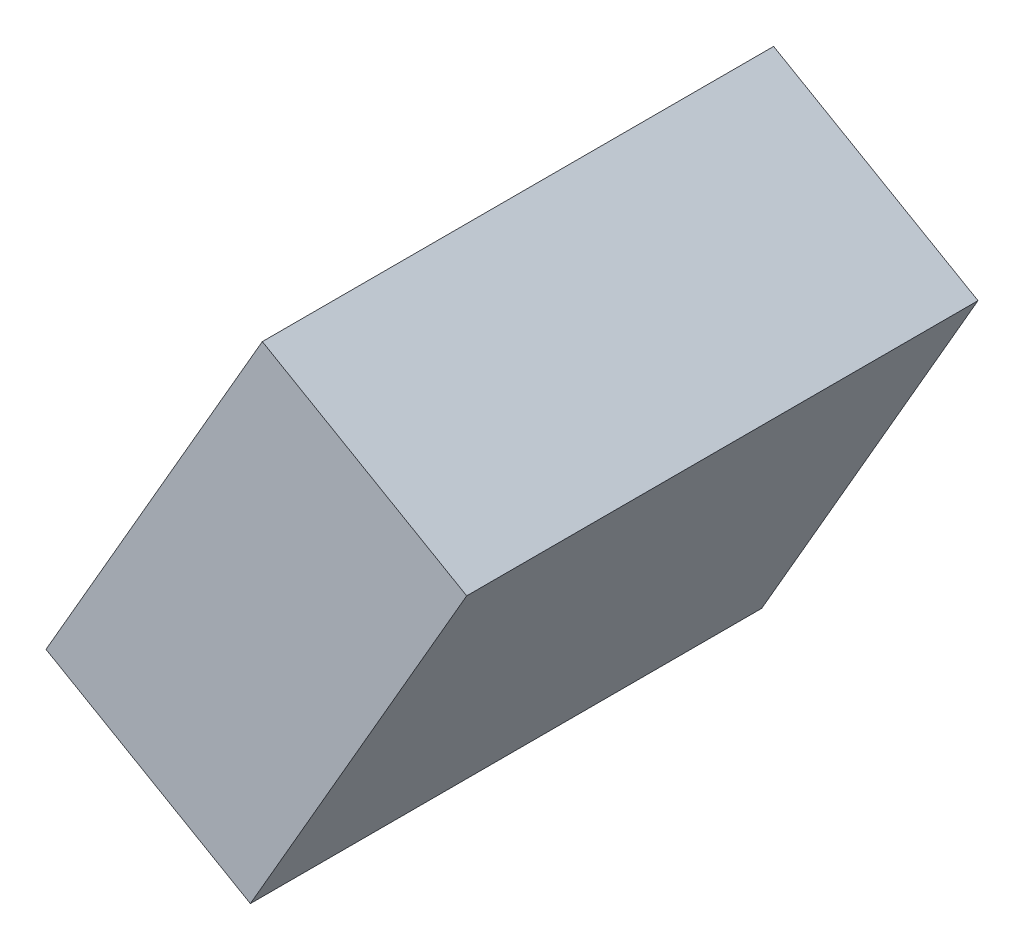
ISO-10303-21;
HEADER;
FILE_DESCRIPTION(('STEP AP214'),'2;1');
FILE_NAME('part.step','',(''),(''),'','','');
FILE_SCHEMA(('AUTOMOTIVE_DESIGN { 1 0 10303 214 1 1 1 1 }'));
ENDSEC;
DATA;
#1=APPLICATION_CONTEXT('core data for automotive mechanical design processes');
#2=APPLICATION_PROTOCOL_DEFINITION('international standard','automotive_design',2000,#1);
#3=PRODUCT_CONTEXT('',#1,'mechanical');
#4=PRODUCT('Part','Part','',(#3));
#5=PRODUCT_RELATED_PRODUCT_CATEGORY('part','',(#4));
#6=PRODUCT_DEFINITION_FORMATION('','',#4);
#7=PRODUCT_DEFINITION_CONTEXT('part definition',#1,'design');
#8=PRODUCT_DEFINITION('design','',#6,#7);
#9=PRODUCT_DEFINITION_SHAPE('','',#8);
#10=(LENGTH_UNIT() NAMED_UNIT(*) SI_UNIT(.MILLI.,.METRE.));
#11=(NAMED_UNIT(*) PLANE_ANGLE_UNIT() SI_UNIT($,.RADIAN.));
#12=(NAMED_UNIT(*) SI_UNIT($,.STERADIAN.) SOLID_ANGLE_UNIT());
#13=UNCERTAINTY_MEASURE_WITH_UNIT(LENGTH_MEASURE(1.E-05),#10,'distance_accuracy_value','');
#14=(GEOMETRIC_REPRESENTATION_CONTEXT(3) GLOBAL_UNCERTAINTY_ASSIGNED_CONTEXT((#13)) GLOBAL_UNIT_ASSIGNED_CONTEXT((#10,
#11,#12)) REPRESENTATION_CONTEXT('',''));
#15=CARTESIAN_POINT('',(0.,0.,0.));
#16=DIRECTION('',(0.,0.,1.));
#17=DIRECTION('',(1.,0.,0.));
#18=AXIS2_PLACEMENT_3D('',#15,#16,#17);
#19=CARTESIAN_POINT('',(-0.01519174000001,-0.62631066,0.));
#20=DIRECTION('',(-0.866024467662735,0.500001621406847,0.));
#21=DIRECTION('',(-0.500001621406847,-0.866024467662735,0.));
#22=AXIS2_PLACEMENT_3D('',#19,#20,#21);
#23=PLANE('',#22);
#24=DIRECTION('',(0.,0.,1.));
#25=VECTOR('',#24,1.);
#26=CARTESIAN_POINT('',(0.53480716,0.32631126,0.));
#27=LINE('',#26,#25);
#28=CARTESIAN_POINT('',(0.534807160000023,0.326311259999987,0.));
#29=VERTEX_POINT('',#28);
#30=CARTESIAN_POINT('',(0.534807160000023,0.326311259999987,1.29999994));
#31=VERTEX_POINT('',#30);
#32=EDGE_CURVE('E19',#29,#31,#27,.T.);
#33=ORIENTED_EDGE('',*,*,#32,.T.);
#34=DIRECTION('',(-0.500001621406764,-0.866024467662783,0.));
#35=VECTOR('',#34,1.);
#36=CARTESIAN_POINT('',(0.53480716,0.32631126,1.29999994));
#37=LINE('',#36,#35);
#38=CARTESIAN_POINT('',(-0.0151917399999705,-0.626310659999932,1.29999994));
#39=VERTEX_POINT('',#38);
#40=EDGE_CURVE('E54',#31,#39,#37,.T.);
#41=ORIENTED_EDGE('',*,*,#40,.T.);
#42=DIRECTION('',(0.,0.,1.));
#43=VECTOR('',#42,1.);
#44=CARTESIAN_POINT('',(-0.0151917399998524,-0.626310659999727,0.));
#45=LINE('',#44,#43);
#46=CARTESIAN_POINT('',(-0.0151917399999705,-0.626310659999932,0.));
#47=VERTEX_POINT('',#46);
#48=EDGE_CURVE('E75',#39,#47,#45,.F.);
#49=ORIENTED_EDGE('',*,*,#48,.T.);
#50=DIRECTION('',(-0.500001621406764,-0.866024467662783,0.));
#51=VECTOR('',#50,1.);
#52=CARTESIAN_POINT('',(0.53480716,0.32631126,0.));
#53=LINE('',#52,#51);
#54=EDGE_CURVE('E57',#29,#47,#53,.T.);
#55=ORIENTED_EDGE('',*,*,#54,.F.);
#56=EDGE_LOOP('',(#33,#41,#49,#55));
#57=FACE_BOUND('',#56,.T.);
#58=ADVANCED_FACE('F16',(#57),#23,.F.);
#59=CARTESIAN_POINT('',(0.53480716,0.32631126,0.));
#60=DIRECTION('',(-0.500002296729118,-0.866024077763204,0.));
#61=DIRECTION('',(0.866024077763204,-0.500002296729118,0.));
#62=AXIS2_PLACEMENT_3D('',#59,#60,#61);
#63=PLANE('',#62);
#64=DIRECTION('',(0.,0.,1.));
#65=VECTOR('',#64,1.);
#66=CARTESIAN_POINT('',(0.01519173999998,0.6263132,0.));
#67=LINE('',#66,#65);
#68=CARTESIAN_POINT('',(0.0151917400000308,0.626313200000088,0.));
#69=VERTEX_POINT('',#68);
#70=CARTESIAN_POINT('',(0.0151917400000308,0.626313200000088,1.29999994));
#71=VERTEX_POINT('',#70);
#72=EDGE_CURVE('E72',#69,#71,#67,.T.);
#73=ORIENTED_EDGE('',*,*,#72,.T.);
#74=DIRECTION('',(0.866024077763373,-0.500002296728824,0.));
#75=VECTOR('',#74,1.);
#76=CARTESIAN_POINT('',(0.01519173999998,0.6263132,1.29999994));
#77=LINE('',#76,#75);
#78=EDGE_CURVE('E62',#71,#31,#77,.T.);
#79=ORIENTED_EDGE('',*,*,#78,.T.);
#80=ORIENTED_EDGE('',*,*,#32,.F.);
#81=DIRECTION('',(0.866024077763373,-0.500002296728824,0.));
#82=VECTOR('',#81,1.);
#83=CARTESIAN_POINT('',(0.01519173999998,0.6263132,0.));
#84=LINE('',#83,#82);
#85=EDGE_CURVE('E77',#69,#29,#84,.T.);
#86=ORIENTED_EDGE('',*,*,#85,.F.);
#87=EDGE_LOOP('',(#73,#79,#80,#86));
#88=FACE_BOUND('',#87,.T.);
#89=ADVANCED_FACE('F71',(#88),#63,.F.);
#90=CARTESIAN_POINT('',(0.01519173999998,0.6263132,1.29999994));
#91=DIRECTION('',(0.,0.,-1.));
#92=DIRECTION('',(-1.,0.,0.));
#93=AXIS2_PLACEMENT_3D('',#90,#91,#92);
#94=PLANE('',#93);
#95=DIRECTION('',(-0.866025910850967,0.499999121733981,0.));
#96=VECTOR('',#95,1.);
#97=CARTESIAN_POINT('',(-0.53480716,-0.32631126,1.29999994));
#98=LINE('',#97,#96);
#99=CARTESIAN_POINT('',(-0.534807159999883,-0.326311260000067,1.29999994));
#100=VERTEX_POINT('',#99);
#101=EDGE_CURVE('E68',#100,#39,#98,.F.);
#102=ORIENTED_EDGE('',*,*,#101,.T.);
#103=ORIENTED_EDGE('',*,*,#40,.F.);
#104=ORIENTED_EDGE('',*,*,#78,.F.);
#105=DIRECTION('',(0.500000621534888,0.866025044940806,0.));
#106=VECTOR('',#105,1.);
#107=CARTESIAN_POINT('',(0.01519173999998,0.6263132,1.29999994));
#108=LINE('',#107,#106);
#109=EDGE_CURVE('E82',#71,#100,#108,.F.);
#110=ORIENTED_EDGE('',*,*,#109,.T.);
#111=EDGE_LOOP('',(#102,#103,#104,#110));
#112=FACE_BOUND('',#111,.T.);
#113=ADVANCED_FACE('F65',(#112),#94,.F.);
#114=CARTESIAN_POINT('',(-0.53480716,-0.32631126,0.));
#115=DIRECTION('',(0.499999121733981,0.866025910850967,0.));
#116=DIRECTION('',(-0.866025910850967,0.499999121733981,0.));
#117=AXIS2_PLACEMENT_3D('',#114,#115,#116);
#118=PLANE('',#117);
#119=ORIENTED_EDGE('',*,*,#48,.F.);
#120=ORIENTED_EDGE('',*,*,#101,.F.);
#121=DIRECTION('',(0.,0.,1.));
#122=VECTOR('',#121,1.);
#123=CARTESIAN_POINT('',(-0.534807159999533,-0.32631126000027,0.));
#124=LINE('',#123,#122);
#125=CARTESIAN_POINT('',(-0.534807159999883,-0.326311260000067,0.));
#126=VERTEX_POINT('',#125);
#127=EDGE_CURVE('E25',#100,#126,#124,.F.);
#128=ORIENTED_EDGE('',*,*,#127,.T.);
#129=DIRECTION('',(-0.866025910850705,0.499999121734436,0.));
#130=VECTOR('',#129,1.);
#131=CARTESIAN_POINT('',(-0.01519174000001,-0.62631066,0.));
#132=LINE('',#131,#130);
#133=EDGE_CURVE('E33',#47,#126,#132,.T.);
#134=ORIENTED_EDGE('',*,*,#133,.F.);
#135=EDGE_LOOP('',(#119,#120,#128,#134));
#136=FACE_BOUND('',#135,.T.);
#137=ADVANCED_FACE('F87',(#136),#118,.F.);
#138=CARTESIAN_POINT('',(0.01519173999998,0.6263132,0.));
#139=DIRECTION('',(0.,0.,-1.));
#140=DIRECTION('',(-1.,0.,0.));
#141=AXIS2_PLACEMENT_3D('',#138,#139,#140);
#142=PLANE('',#141);
#143=ORIENTED_EDGE('',*,*,#133,.T.);
#144=DIRECTION('',(0.500000621534888,0.866025044940806,0.));
#145=VECTOR('',#144,1.);
#146=CARTESIAN_POINT('',(0.01519173999998,0.6263132,0.));
#147=LINE('',#146,#145);
#148=EDGE_CURVE('E11',#126,#69,#147,.T.);
#149=ORIENTED_EDGE('',*,*,#148,.T.);
#150=ORIENTED_EDGE('',*,*,#85,.T.);
#151=ORIENTED_EDGE('',*,*,#54,.T.);
#152=EDGE_LOOP('',(#143,#149,#150,#151));
#153=FACE_BOUND('',#152,.T.);
#154=ADVANCED_FACE('F90',(#153),#142,.T.);
#155=CARTESIAN_POINT('',(0.01519173999998,0.6263132,0.));
#156=DIRECTION('',(0.866025044940806,-0.500000621534888,0.));
#157=DIRECTION('',(0.500000621534888,0.866025044940806,0.));
#158=AXIS2_PLACEMENT_3D('',#155,#156,#157);
#159=PLANE('',#158);
#160=ORIENTED_EDGE('',*,*,#127,.F.);
#161=ORIENTED_EDGE('',*,*,#109,.F.);
#162=ORIENTED_EDGE('',*,*,#72,.F.);
#163=ORIENTED_EDGE('',*,*,#148,.F.);
#164=EDGE_LOOP('',(#160,#161,#162,#163));
#165=FACE_BOUND('',#164,.T.);
#166=ADVANCED_FACE('F89',(#165),#159,.F.);
#167=CLOSED_SHELL('',(#58,#89,#113,#137,#154,#166));
#168=MANIFOLD_SOLID_BREP('B1',#167);
#169=ADVANCED_BREP_SHAPE_REPRESENTATION('',(#18,#168),#14);
#170=SHAPE_DEFINITION_REPRESENTATION(#9,#169);
ENDSEC;
END-ISO-10303-21;
